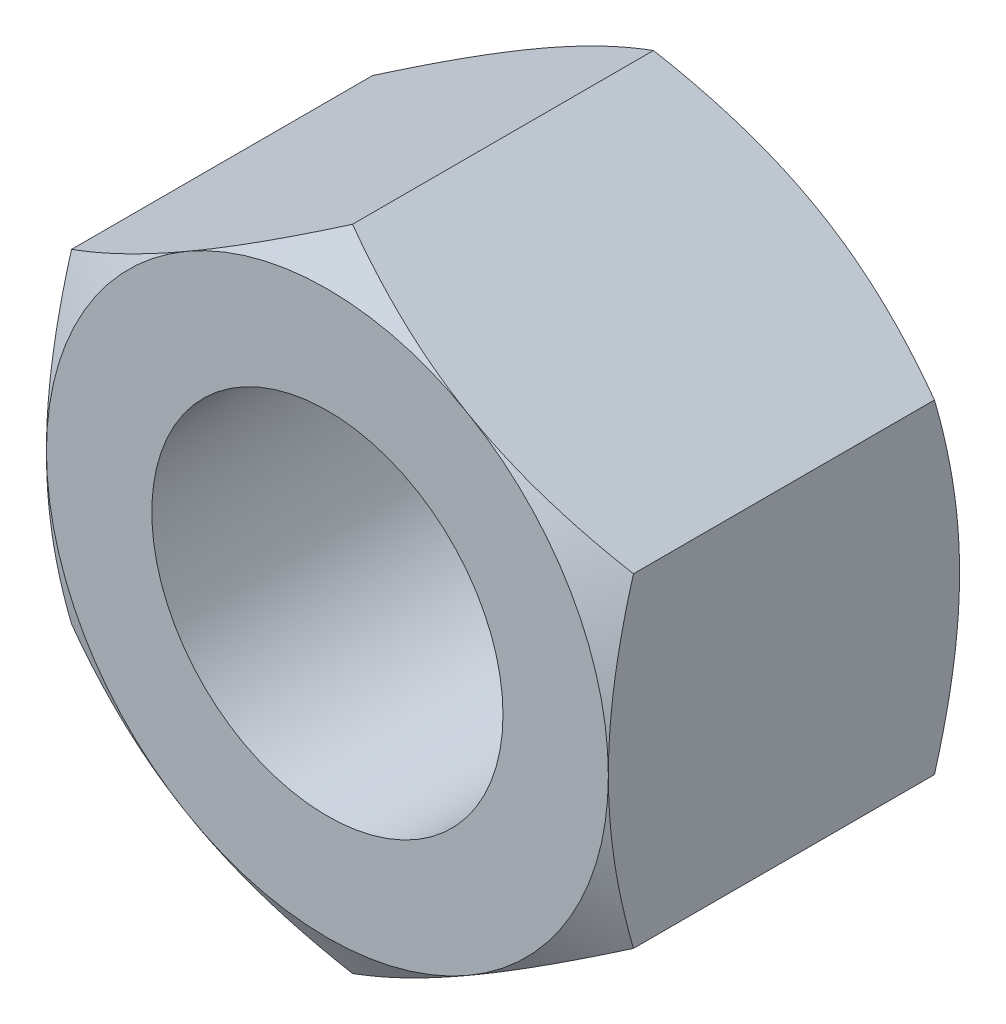
ISO-10303-21;
HEADER;
FILE_DESCRIPTION(('STEP AP214'),'2;1');
FILE_NAME('part.step','',(''),(''),'','','');
FILE_SCHEMA(('AUTOMOTIVE_DESIGN { 1 0 10303 214 1 1 1 1 }'));
ENDSEC;
DATA;
#1=APPLICATION_CONTEXT('core data for automotive mechanical design processes');
#2=APPLICATION_PROTOCOL_DEFINITION('international standard','automotive_design',2000,#1);
#3=PRODUCT_CONTEXT('',#1,'mechanical');
#4=PRODUCT('Part','Part','',(#3));
#5=PRODUCT_RELATED_PRODUCT_CATEGORY('part','',(#4));
#6=PRODUCT_DEFINITION_FORMATION('','',#4);
#7=PRODUCT_DEFINITION_CONTEXT('part definition',#1,'design');
#8=PRODUCT_DEFINITION('design','',#6,#7);
#9=PRODUCT_DEFINITION_SHAPE('','',#8);
#10=(LENGTH_UNIT() NAMED_UNIT(*) SI_UNIT(.MILLI.,.METRE.));
#11=(NAMED_UNIT(*) PLANE_ANGLE_UNIT() SI_UNIT($,.RADIAN.));
#12=(NAMED_UNIT(*) SI_UNIT($,.STERADIAN.) SOLID_ANGLE_UNIT());
#13=UNCERTAINTY_MEASURE_WITH_UNIT(LENGTH_MEASURE(1.E-05),#10,'distance_accuracy_value','');
#14=(GEOMETRIC_REPRESENTATION_CONTEXT(3) GLOBAL_UNCERTAINTY_ASSIGNED_CONTEXT((#13)) GLOBAL_UNIT_ASSIGNED_CONTEXT((#10,
#11,#12)) REPRESENTATION_CONTEXT('',''));
#15=CARTESIAN_POINT('',(0.,0.,0.));
#16=DIRECTION('',(0.,0.,1.));
#17=DIRECTION('',(1.,0.,0.));
#18=AXIS2_PLACEMENT_3D('',#15,#16,#17);
#19=CARTESIAN_POINT('',(0.,0.,5.));
#20=DIRECTION('',(0.,0.,1.));
#21=DIRECTION('',(1.,0.,0.));
#22=AXIS2_PLACEMENT_3D('',#19,#20,#21);
#23=PLANE('',#22);
#24=CARTESIAN_POINT('',(0.,0.,5.));
#25=DIRECTION('',(0.,0.,1.));
#26=DIRECTION('',(1.,0.,0.));
#27=AXIS2_PLACEMENT_3D('',#24,#25,#26);
#28=CIRCLE('',#27,3.99999999999999);
#29=CARTESIAN_POINT('',(4.,0.,5.));
#30=VERTEX_POINT('',#29);
#31=CARTESIAN_POINT('',(2.00000000000001,-3.46410161513775,5.));
#32=VERTEX_POINT('',#31);
#33=EDGE_CURVE('E11',#30,#32,#28,.F.);
#34=ORIENTED_EDGE('',*,*,#33,.F.);
#35=CARTESIAN_POINT('',(2.00000000000001,3.46410161513775,5.));
#36=VERTEX_POINT('',#35);
#37=EDGE_CURVE('E38',#36,#30,#28,.F.);
#38=ORIENTED_EDGE('',*,*,#37,.F.);
#39=CARTESIAN_POINT('',(-1.99999999999999,3.46410161513776,5.));
#40=VERTEX_POINT('',#39);
#41=EDGE_CURVE('E277',#40,#36,#28,.F.);
#42=ORIENTED_EDGE('',*,*,#41,.F.);
#43=CARTESIAN_POINT('',(-4.,0.,5.));
#44=VERTEX_POINT('',#43);
#45=EDGE_CURVE('E281',#44,#40,#28,.F.);
#46=ORIENTED_EDGE('',*,*,#45,.F.);
#47=CARTESIAN_POINT('',(-1.99999999999999,-3.46410161513776,5.));
#48=VERTEX_POINT('',#47);
#49=EDGE_CURVE('E305',#48,#44,#28,.F.);
#50=ORIENTED_EDGE('',*,*,#49,.F.);
#51=EDGE_CURVE('E43',#32,#48,#28,.F.);
#52=ORIENTED_EDGE('',*,*,#51,.F.);
#53=EDGE_LOOP('',(#34,#38,#42,#46,#50,#52));
#54=FACE_BOUND('',#53,.T.);
#55=CARTESIAN_POINT('',(0.,0.,5.));
#56=DIRECTION('',(0.,0.,1.));
#57=DIRECTION('',(1.,0.,0.));
#58=AXIS2_PLACEMENT_3D('',#55,#56,#57);
#59=CIRCLE('',#58,2.5);
#60=CARTESIAN_POINT('',(2.5,0.,5.));
#61=VERTEX_POINT('',#60);
#62=EDGE_CURVE('E248',#61,#61,#59,.T.);
#63=ORIENTED_EDGE('',*,*,#62,.F.);
#64=EDGE_LOOP('',(#63));
#65=FACE_BOUND('',#64,.T.);
#66=ADVANCED_FACE('F33',(#54,#65),#23,.T.);
#67=CARTESIAN_POINT('',(0.,0.,0.));
#68=DIRECTION('',(0.,0.,1.));
#69=DIRECTION('',(1.,0.,0.));
#70=AXIS2_PLACEMENT_3D('',#67,#68,#69);
#71=PLANE('',#70);
#72=CARTESIAN_POINT('',(0.,0.,0.));
#73=DIRECTION('',(0.,0.,1.));
#74=DIRECTION('',(1.,0.,0.));
#75=AXIS2_PLACEMENT_3D('',#72,#73,#74);
#76=CIRCLE('',#75,2.5);
#77=CARTESIAN_POINT('',(2.5,0.,0.));
#78=VERTEX_POINT('',#77);
#79=EDGE_CURVE('E251',#78,#78,#76,.F.);
#80=ORIENTED_EDGE('',*,*,#79,.F.);
#81=EDGE_LOOP('',(#80));
#82=FACE_BOUND('',#81,.T.);
#83=CARTESIAN_POINT('',(0.,0.,0.));
#84=DIRECTION('',(0.,0.,1.));
#85=DIRECTION('',(1.,0.,0.));
#86=AXIS2_PLACEMENT_3D('',#83,#84,#85);
#87=CIRCLE('',#86,3.99999999999999);
#88=CARTESIAN_POINT('',(2.,3.46410161513775,0.));
#89=VERTEX_POINT('',#88);
#90=CARTESIAN_POINT('',(4.,0.,0.));
#91=VERTEX_POINT('',#90);
#92=EDGE_CURVE('E142',#89,#91,#87,.F.);
#93=ORIENTED_EDGE('',*,*,#92,.T.);
#94=CARTESIAN_POINT('',(2.,-3.46410161513776,0.));
#95=VERTEX_POINT('',#94);
#96=EDGE_CURVE('E150',#91,#95,#87,.F.);
#97=ORIENTED_EDGE('',*,*,#96,.T.);
#98=CARTESIAN_POINT('',(-2.,-3.46410161513776,0.));
#99=VERTEX_POINT('',#98);
#100=EDGE_CURVE('E288',#95,#99,#87,.F.);
#101=ORIENTED_EDGE('',*,*,#100,.T.);
#102=CARTESIAN_POINT('',(-4.,0.,0.));
#103=VERTEX_POINT('',#102);
#104=EDGE_CURVE('E291',#99,#103,#87,.F.);
#105=ORIENTED_EDGE('',*,*,#104,.T.);
#106=CARTESIAN_POINT('',(-2.,3.46410161513776,0.));
#107=VERTEX_POINT('',#106);
#108=EDGE_CURVE('E154',#103,#107,#87,.F.);
#109=ORIENTED_EDGE('',*,*,#108,.T.);
#110=EDGE_CURVE('E128',#107,#89,#87,.F.);
#111=ORIENTED_EDGE('',*,*,#110,.T.);
#112=EDGE_LOOP('',(#93,#97,#101,#105,#109,#111));
#113=FACE_BOUND('',#112,.T.);
#114=ADVANCED_FACE('F151',(#82,#113),#71,.F.);
#115=CARTESIAN_POINT('',(0.,0.,-0.00100000000000013));
#116=DIRECTION('',(0.,0.,1.));
#117=DIRECTION('',(1.,0.,0.));
#118=AXIS2_PLACEMENT_3D('',#115,#116,#117);
#119=CYLINDRICAL_SURFACE('',#118,2.5);
#120=ORIENTED_EDGE('',*,*,#62,.T.);
#121=EDGE_LOOP('',(#120));
#122=FACE_BOUND('',#121,.T.);
#123=ORIENTED_EDGE('',*,*,#79,.T.);
#124=EDGE_LOOP('',(#123));
#125=FACE_BOUND('',#124,.T.);
#126=ADVANCED_FACE('F333',(#122,#125),#119,.F.);
#127=CARTESIAN_POINT('',(0.,0.,2.49999999999999));
#128=DIRECTION('',(0.,0.,1.));
#129=DIRECTION('',(1.,0.,0.));
#130=AXIS2_PLACEMENT_3D('',#127,#128,#129);
#131=CONICAL_SURFACE('',#130,8.33012701892224,1.0471975511966);
#132=CARTESIAN_POINT('',(4.,-6.24956479429045,1.97456360244672));
#133=CARTESIAN_POINT('',(4.,-6.07444156413654,1.88942827325907));
#134=CARTESIAN_POINT('',(4.,-5.89892120925633,1.80509607824784));
#135=CARTESIAN_POINT('',(4.,-5.54687519091733,1.63848882539641));
#136=CARTESIAN_POINT('',(4.,-5.37034937829518,1.55621408309027));
#137=CARTESIAN_POINT('',(4.,-5.01519415342951,1.39376866021859));
#138=CARTESIAN_POINT('',(4.,-4.83655854832306,1.31361147319812));
#139=CARTESIAN_POINT('',(4.,-4.47788234370767,1.15651692570027));
#140=CARTESIAN_POINT('',(4.,-4.29784180976291,1.07957941602297));
#141=CARTESIAN_POINT('',(4.,-3.93013224001484,0.927314347669686));
#142=CARTESIAN_POINT('',(4.,-3.74240672926811,0.852122439616751));
#143=CARTESIAN_POINT('',(4.,-3.36477669699491,0.707318313824162));
#144=CARTESIAN_POINT('',(4.,-3.17487193622275,0.637706715540834));
#145=CARTESIAN_POINT('',(4.,-2.79292180874069,0.505856446606606));
#146=CARTESIAN_POINT('',(4.,-2.60088150479679,0.443603254920114));
#147=CARTESIAN_POINT('',(4.,-2.21404661724717,0.328436603960456));
#148=CARTESIAN_POINT('',(4.,-2.01925290675912,0.275520252647028));
#149=CARTESIAN_POINT('',(4.,-1.62786565756198,0.181813669941697));
#150=CARTESIAN_POINT('',(4.,-1.43128819547987,0.140957514167184));
#151=CARTESIAN_POINT('',(4.,-1.03564122557711,0.0736566788754475));
#152=CARTESIAN_POINT('',(4.,-0.836571977728894,0.0472105085497938));
#153=CARTESIAN_POINT('',(4.,-0.43955577127103,0.0111835710773818));
#154=CARTESIAN_POINT('',(4.,-0.241629330228168,0.00138228122554302));
#155=CARTESIAN_POINT('',(4.,0.15435054835947,-0.00110741340924523));
#156=CARTESIAN_POINT('',(4.,0.352403988458628,0.00620453754175364));
#157=CARTESIAN_POINT('',(4.,0.687236250688567,0.032510892652731));
#158=CARTESIAN_POINT('',(4.,0.824367793925697,0.0472858846929974));
#159=CARTESIAN_POINT('',(4.,1.09765152952022,0.0841455799911596));
#160=CARTESIAN_POINT('',(4.,1.23380359194277,0.106231235433355));
#161=CARTESIAN_POINT('',(4.,1.6405917983731,0.18229587673389));
#162=CARTESIAN_POINT('',(4.,1.90941813145405,0.246069891819845));
#163=CARTESIAN_POINT('',(4.,2.31153879676533,0.356988486413043));
#164=CARTESIAN_POINT('',(4.,2.44690727933547,0.397044262071004));
#165=CARTESIAN_POINT('',(4.,2.71632951260011,0.481395746605353));
#166=CARTESIAN_POINT('',(4.,2.85038325360041,0.525691486719118));
#167=CARTESIAN_POINT('',(4.,3.11721830577763,0.617805331265835));
#168=CARTESIAN_POINT('',(4.,3.24999999051481,0.665622363398113));
#169=CARTESIAN_POINT('',(4.,3.51445652868967,0.764208166002603));
#170=CARTESIAN_POINT('',(4.,3.64613140388332,0.814976878299175));
#171=CARTESIAN_POINT('',(4.,3.98960714481433,0.951124538665885));
#172=CARTESIAN_POINT('',(4.,4.20061716756433,1.03849638210907));
#173=CARTESIAN_POINT('',(4.,4.62056636292152,1.21809912278108));
#174=CARTESIAN_POINT('',(4.,4.82950533512367,1.31033048489121));
#175=CARTESIAN_POINT('',(4.,5.24576018930462,1.49854028991968));
#176=CARTESIAN_POINT('',(4.,5.45307555654103,1.59451986767299));
#177=CARTESIAN_POINT('',(4.,5.86634547345445,1.7893711183019));
#178=CARTESIAN_POINT('',(4.,6.07229998492681,1.88824287195307));
#179=CARTESIAN_POINT('',(4.,6.48339063309609,2.08840661813017));
#180=CARTESIAN_POINT('',(4.,6.68852518457306,2.18970185997189));
#181=CARTESIAN_POINT('',(4.,7.09788129540636,2.39412248897985));
#182=CARTESIAN_POINT('',(4.,7.302102845505,2.49724789465118));
#183=CARTESIAN_POINT('',(4.,7.91356393553836,2.80878595966479));
#184=CARTESIAN_POINT('',(4.,8.3196812269123,3.01940043013483));
#185=CARTESIAN_POINT('',(4.,9.08923369645318,3.42329199215687));
#186=CARTESIAN_POINT('',(4.,9.45286795571535,3.61619156178197));
#187=CARTESIAN_POINT('',(4.,10.1788898998377,4.00436787612635));
#188=CARTESIAN_POINT('',(4.,10.5412775165095,4.19964474830796));
#189=CARTESIAN_POINT('',(4.,11.2639691493924,4.59136023392863));
#190=CARTESIAN_POINT('',(4.,11.6242761419106,4.78779336487934));
#191=CARTESIAN_POINT('',(4.,12.344109455928,5.1820245684433));
#192=CARTESIAN_POINT('',(4.,12.7036358313906,5.37982254248305));
#193=CARTESIAN_POINT('',(4.,13.0628848233634,5.57811986686827));
#194=B_SPLINE_CURVE_WITH_KNOTS('',3,(#132,#133,#134,#135,#136,#137,#138,#139,#140,#141,#142,
#143,#144,#145,#146,#147,#148,#149,#150,#151,#152,#153,#154,#155,#156,#157,#158,#159,#160,#161,
#162,#163,#164,#165,#166,#167,#168,#169,#170,#171,#172,#173,#174,#175,#176,#177,#178,#179,#180,
#181,#182,#183,#184,#185,#186,#187,#188,#189,#190,#191,#192,#193),.UNSPECIFIED.,.F.,.F.,(4,2,2,
2,2,2,2,2,2,2,2,2,2,2,2,2,2,2,2,2,2,2,2,2,2,2,2,2,2,2,4),(0.,0.584169167729591,1.16842738181916,
1.75578823273105,2.3431218351209,2.94972631181604,3.55639803318819,4.16185182498552,
4.76711774997747,5.36901110458358,5.97084217750695,6.56463571900412,7.15844160383236,
7.57201755614221,7.98564739625398,8.81333230952328,9.23680647972617,9.66028377005908,
10.0836326325238,10.5069731538927,11.1920349716865,11.8771624446906,12.5624989846245,
13.2478546836303,13.9341874141275,14.6205270882075,15.9929346612935,17.2278187412332,
18.4627693253535,19.6938892311648,20.9249211331408),.UNSPECIFIED.);
#195=CARTESIAN_POINT('',(4.,2.3094010767585,0.35726558990816));
#196=VERTEX_POINT('',#195);
#197=EDGE_CURVE('E145',#91,#196,#194,.T.);
#198=ORIENTED_EDGE('',*,*,#197,.F.);
#199=ORIENTED_EDGE('',*,*,#92,.F.);
#200=CARTESIAN_POINT('',(4.0002,2.30928560670467,0.357332259074763));
#201=CARTESIAN_POINT('',(3.82442084967677,2.4107717464617,0.29871787364828));
#202=CARTESIAN_POINT('',(3.64712438367362,2.51313390883499,0.245410321462261));
#203=CARTESIAN_POINT('',(3.28946140682429,2.71963072479812,0.152361670746403));
#204=CARTESIAN_POINT('',(3.10908854102985,2.82376904741904,0.112653489029704));
#205=CARTESIAN_POINT('',(2.75057818129721,3.03075510011795,0.0508422152802797));
#206=CARTESIAN_POINT('',(2.57249584706486,3.13357098372492,0.0283277315228901));
#207=CARTESIAN_POINT('',(2.21549328283349,3.33968651028528,0.00145062314658378));
#208=CARTESIAN_POINT('',(2.0365743503559,3.44298540411434,-0.00293425857305483));
#209=CARTESIAN_POINT('',(1.70225715780327,3.63600352522932,0.00619007293997213));
#210=CARTESIAN_POINT('',(1.54680884001293,3.72575165335065,0.017458953987996));
#211=CARTESIAN_POINT('',(1.23692494436494,3.90466320392054,0.0531739907981946));
#212=CARTESIAN_POINT('',(1.08249043825587,3.99382600759478,0.0776323457115342));
#213=CARTESIAN_POINT('',(0.771967672225422,4.17310641015197,0.13877606491929));
#214=CARTESIAN_POINT('',(0.615918711936898,4.26320131938131,0.175720603654864));
#215=CARTESIAN_POINT('',(0.306148164596161,4.4420474282755,0.259570072548027));
#216=CARTESIAN_POINT('',(0.152422609226221,4.53080091904966,0.30645530221274));
#217=CARTESIAN_POINT('',(-0.00019999999999995,4.61891762357084,0.357332259074765));
#218=B_SPLINE_CURVE_WITH_KNOTS('',3,(#200,#201,#202,#203,#204,#205,#206,#207,#208,#209,#210,
#211,#212,#213,#214,#215,#216,#217),.UNSPECIFIED.,.F.,.F.,(4,2,2,2,2,2,2,2,4),(0.,
0.634047835695966,1.26961969224543,1.88946157213122,2.50854226669297,3.04757825393386,
3.58711366126903,4.13861653143764,4.68903648037743),.UNSPECIFIED.);
#219=EDGE_CURVE('E138',#196,#89,#218,.T.);
#220=ORIENTED_EDGE('',*,*,#219,.F.);
#221=EDGE_LOOP('',(#198,#199,#220));
#222=FACE_BOUND('',#221,.T.);
#223=ADVANCED_FACE('F143',(#222),#131,.T.);
#224=CARTESIAN_POINT('',(0.,4.61880215351701,0.357265589908162));
#225=VERTEX_POINT('',#224);
#226=EDGE_CURVE('E124',#89,#225,#218,.T.);
#227=ORIENTED_EDGE('',*,*,#226,.F.);
#228=ORIENTED_EDGE('',*,*,#110,.F.);
#229=CARTESIAN_POINT('',(0.000199999999999757,4.61891762357084,0.357332259074766));
#230=CARTESIAN_POINT('',(-0.175579150323229,4.5174314838138,0.298717873648282));
#231=CARTESIAN_POINT('',(-0.352875616326381,4.41506932144052,0.245410321462263));
#232=CARTESIAN_POINT('',(-0.710538593175706,4.2085725054774,0.152361670746405));
#233=CARTESIAN_POINT('',(-0.89091145897015,4.10443418285647,0.112653489029706));
#234=CARTESIAN_POINT('',(-1.24942181870279,3.89744813015756,0.0508422152802819));
#235=CARTESIAN_POINT('',(-1.42750415293514,3.79463224655059,0.028327731522892));
#236=CARTESIAN_POINT('',(-1.78450671716651,3.58851671999023,0.00145062314658541));
#237=CARTESIAN_POINT('',(-1.9634256496441,3.48521782616117,-0.00293425857305299));
#238=CARTESIAN_POINT('',(-2.29774284219673,3.29219970504619,0.00619007293997381));
#239=CARTESIAN_POINT('',(-2.45319115998707,3.20245157692486,0.0174589539879975));
#240=CARTESIAN_POINT('',(-2.76307505563505,3.02354002635497,0.053173990798196));
#241=CARTESIAN_POINT('',(-2.91750956174413,2.93437722268073,0.0776323457115359));
#242=CARTESIAN_POINT('',(-3.22803232777458,2.75509682012354,0.138776064919292));
#243=CARTESIAN_POINT('',(-3.3840812880631,2.6650019108942,0.175720603654865));
#244=CARTESIAN_POINT('',(-3.69385183540384,2.48615580200001,0.259570072548028));
#245=CARTESIAN_POINT('',(-3.84757739077378,2.39740231122585,0.306455302212741));
#246=CARTESIAN_POINT('',(-4.0002,2.30928560670467,0.357332259074768));
#247=B_SPLINE_CURVE_WITH_KNOTS('',3,(#229,#230,#231,#232,#233,#234,#235,#236,#237,#238,#239,
#240,#241,#242,#243,#244,#245,#246),.UNSPECIFIED.,.F.,.F.,(4,2,2,2,2,2,2,2,4),(0.,
0.634047835695965,1.26961969224543,1.88946157213122,2.50854226669297,3.04757825393385,
3.58711366126903,4.13861653143764,4.68903648037743),.UNSPECIFIED.);
#248=EDGE_CURVE('E131',#225,#107,#247,.T.);
#249=ORIENTED_EDGE('',*,*,#248,.F.);
#250=EDGE_LOOP('',(#227,#228,#249));
#251=FACE_BOUND('',#250,.T.);
#252=ADVANCED_FACE('F126',(#251),#131,.T.);
#253=CARTESIAN_POINT('',(-4.,2.3094010767585,0.357265589908164));
#254=VERTEX_POINT('',#253);
#255=EDGE_CURVE('E204',#107,#254,#247,.T.);
#256=ORIENTED_EDGE('',*,*,#255,.F.);
#257=ORIENTED_EDGE('',*,*,#108,.F.);
#258=CARTESIAN_POINT('',(-4.,-6.24956479429043,1.97456360244672));
#259=CARTESIAN_POINT('',(-4.,-6.07444156413653,1.88942827325907));
#260=CARTESIAN_POINT('',(-4.,-5.89892120925632,1.80509607824784));
#261=CARTESIAN_POINT('',(-4.,-5.54687519091731,1.63848882539642));
#262=CARTESIAN_POINT('',(-4.,-5.37034937829516,1.55621408309027));
#263=CARTESIAN_POINT('',(-4.,-5.01519415342949,1.39376866021859));
#264=CARTESIAN_POINT('',(-4.,-4.83655854832305,1.31361147319813));
#265=CARTESIAN_POINT('',(-4.,-4.47788234370766,1.15651692570027));
#266=CARTESIAN_POINT('',(-4.,-4.29784180976289,1.07957941602297));
#267=CARTESIAN_POINT('',(-4.,-3.93013224001483,0.927314347669689));
#268=CARTESIAN_POINT('',(-4.,-3.7424067292681,0.852122439616753));
#269=CARTESIAN_POINT('',(-4.,-3.36477669699491,0.707318313824164));
#270=CARTESIAN_POINT('',(-4.,-3.17487193622275,0.637706715540837));
#271=CARTESIAN_POINT('',(-4.,-2.79292180874068,0.505856446606609));
#272=CARTESIAN_POINT('',(-4.,-2.60088150479678,0.443603254920117));
#273=CARTESIAN_POINT('',(-4.,-2.21404661724717,0.32843660396046));
#274=CARTESIAN_POINT('',(-4.,-2.01925290675911,0.275520252647032));
#275=CARTESIAN_POINT('',(-4.,-1.62786565756197,0.181813669941701));
#276=CARTESIAN_POINT('',(-4.,-1.43128819547986,0.140957514167188));
#277=CARTESIAN_POINT('',(-4.,-1.03564122557711,0.0736566788754504));
#278=CARTESIAN_POINT('',(-4.,-0.836571977728894,0.0472105085497965));
#279=CARTESIAN_POINT('',(-4.,-0.439555771271032,0.0111835710773843));
#280=CARTESIAN_POINT('',(-4.,-0.24162933022817,0.0013822812255456));
#281=CARTESIAN_POINT('',(-4.,0.154350548359467,-0.00110741340924309));
#282=CARTESIAN_POINT('',(-4.,0.352403988458625,0.0062045375417553));
#283=CARTESIAN_POINT('',(-4.,0.687236250688563,0.0325108926527331));
#284=CARTESIAN_POINT('',(-4.,0.824367793925693,0.047285884693));
#285=CARTESIAN_POINT('',(-4.,1.09765152952022,0.0841455799911624));
#286=CARTESIAN_POINT('',(-4.,1.23380359194277,0.106231235433357));
#287=CARTESIAN_POINT('',(-4.,1.64059179837309,0.182295876733892));
#288=CARTESIAN_POINT('',(-4.,1.90941813145404,0.246069891819847));
#289=CARTESIAN_POINT('',(-4.,2.31153879676532,0.356988486413044));
#290=CARTESIAN_POINT('',(-4.,2.44690727933546,0.397044262071004));
#291=CARTESIAN_POINT('',(-4.,2.7163295126001,0.481395746605353));
#292=CARTESIAN_POINT('',(-4.,2.85038325360039,0.525691486719117));
#293=CARTESIAN_POINT('',(-4.,3.11721830577761,0.617805331265834));
#294=CARTESIAN_POINT('',(-4.,3.24999999051479,0.665622363398111));
#295=CARTESIAN_POINT('',(-4.,3.51445652868965,0.764208166002601));
#296=CARTESIAN_POINT('',(-4.,3.6461314038833,0.814976878299173));
#297=CARTESIAN_POINT('',(-4.,3.98960714481431,0.951124538665883));
#298=CARTESIAN_POINT('',(-4.,4.20061716756431,1.03849638210907));
#299=CARTESIAN_POINT('',(-4.,4.6205663629215,1.21809912278108));
#300=CARTESIAN_POINT('',(-4.,4.82950533512366,1.3103304848912));
#301=CARTESIAN_POINT('',(-4.,5.2457601893046,1.49854028991968));
#302=CARTESIAN_POINT('',(-4.,5.45307555654102,1.59451986767299));
#303=CARTESIAN_POINT('',(-4.,5.86634547345444,1.7893711183019));
#304=CARTESIAN_POINT('',(-4.,6.07229998492679,1.88824287195307));
#305=CARTESIAN_POINT('',(-4.,6.48339063309607,2.08840661813016));
#306=CARTESIAN_POINT('',(-4.,6.68852518457305,2.18970185997189));
#307=CARTESIAN_POINT('',(-4.,7.09788129540634,2.39412248897985));
#308=CARTESIAN_POINT('',(-4.,7.30210284550498,2.49724789465118));
#309=CARTESIAN_POINT('',(-4.,7.91356393553835,2.80878595966479));
#310=CARTESIAN_POINT('',(-4.,8.31968122691228,3.01940043013483));
#311=CARTESIAN_POINT('',(-4.,9.08923369645316,3.42329199215687));
#312=CARTESIAN_POINT('',(-4.,9.45286795571533,3.61619156178197));
#313=CARTESIAN_POINT('',(-4.,10.1788898998377,4.00436787612635));
#314=CARTESIAN_POINT('',(-4.,10.5412775165095,4.19964474830796));
#315=CARTESIAN_POINT('',(-4.,11.2639691493924,4.59136023392863));
#316=CARTESIAN_POINT('',(-4.,11.6242761419106,4.78779336487933));
#317=CARTESIAN_POINT('',(-4.,12.344109455928,5.1820245684433));
#318=CARTESIAN_POINT('',(-4.,12.7036358313906,5.37982254248305));
#319=CARTESIAN_POINT('',(-4.,13.0628848233633,5.57811986686827));
#320=B_SPLINE_CURVE_WITH_KNOTS('',3,(#258,#259,#260,#261,#262,#263,#264,#265,#266,#267,#268,
#269,#270,#271,#272,#273,#274,#275,#276,#277,#278,#279,#280,#281,#282,#283,#284,#285,#286,#287,
#288,#289,#290,#291,#292,#293,#294,#295,#296,#297,#298,#299,#300,#301,#302,#303,#304,#305,#306,
#307,#308,#309,#310,#311,#312,#313,#314,#315,#316,#317,#318,#319),.UNSPECIFIED.,.F.,.F.,(4,2,2,
2,2,2,2,2,2,2,2,2,2,2,2,2,2,2,2,2,2,2,2,2,2,2,2,2,2,2,4),(0.,0.584169167729592,1.16842738181916,
1.75578823273105,2.3431218351209,2.94972631181603,3.55639803318818,4.16185182498551,
4.76711774997746,5.36901110458357,5.97084217750694,6.5646357190041,7.15844160383234,
7.5720175561422,7.98564739625396,8.81333230952326,9.23680647972614,9.66028377005906,
10.0836326325238,10.5069731538926,11.1920349716865,11.8771624446906,12.5624989846245,
13.2478546836303,13.9341874141274,14.6205270882074,15.9929346612935,17.2278187412331,
18.4627693253534,19.6938892311648,20.9249211331408),.UNSPECIFIED.);
#321=EDGE_CURVE('E197',#254,#103,#320,.F.);
#322=ORIENTED_EDGE('',*,*,#321,.F.);
#323=EDGE_LOOP('',(#256,#257,#322));
#324=FACE_BOUND('',#323,.T.);
#325=ADVANCED_FACE('F300',(#324),#131,.T.);
#326=CARTESIAN_POINT('',(-4.,-2.30940107675886,0.357265589907926));
#327=VERTEX_POINT('',#326);
#328=EDGE_CURVE('E203',#103,#327,#320,.F.);
#329=ORIENTED_EDGE('',*,*,#328,.F.);
#330=ORIENTED_EDGE('',*,*,#104,.F.);
#331=CARTESIAN_POINT('',(-4.0002,-2.30928560670467,0.357332259074767));
#332=CARTESIAN_POINT('',(-3.82442084967677,-2.4107717464617,0.298717873648283));
#333=CARTESIAN_POINT('',(-3.64712438367362,-2.51313390883499,0.245410321462264));
#334=CARTESIAN_POINT('',(-3.28946140682429,-2.71963072479811,0.152361670746406));
#335=CARTESIAN_POINT('',(-3.10908854102985,-2.82376904741904,0.112653489029707));
#336=CARTESIAN_POINT('',(-2.75057818129721,-3.03075510011795,0.0508422152802823));
#337=CARTESIAN_POINT('',(-2.57249584706486,-3.13357098372491,0.0283277315228921));
#338=CARTESIAN_POINT('',(-2.2154932828335,-3.33968651028528,0.00145062314658501));
#339=CARTESIAN_POINT('',(-2.0365743503559,-3.44298540411434,-0.00293425857305367));
#340=CARTESIAN_POINT('',(-1.70225715780327,-3.63600352522932,0.0061900729399727));
#341=CARTESIAN_POINT('',(-1.54680884001294,-3.72575165335064,0.0174589539879962));
#342=CARTESIAN_POINT('',(-1.23692494436495,-3.90466320392054,0.0531739907981946));
#343=CARTESIAN_POINT('',(-1.08249043825587,-3.99382600759478,0.0776323457115344));
#344=CARTESIAN_POINT('',(-0.771967672225424,-4.17310641015197,0.13877606491929));
#345=CARTESIAN_POINT('',(-0.6159187119369,-4.26320131938131,0.175720603654864));
#346=CARTESIAN_POINT('',(-0.306148164596162,-4.4420474282755,0.259570072548026));
#347=CARTESIAN_POINT('',(-0.152422609226222,-4.53080091904966,0.306455302212739));
#348=CARTESIAN_POINT('',(0.000199999999999847,-4.61891762357084,0.357332259074766));
#349=B_SPLINE_CURVE_WITH_KNOTS('',3,(#331,#332,#333,#334,#335,#336,#337,#338,#339,#340,#341,
#342,#343,#344,#345,#346,#347,#348),.UNSPECIFIED.,.F.,.F.,(4,2,2,2,2,2,2,2,4),(0.,
0.634047835695965,1.26961969224543,1.88946157213122,2.50854226669296,3.04757825393385,
3.58711366126903,4.13861653143763,4.68903648037743),.UNSPECIFIED.);
#350=EDGE_CURVE('E205',#327,#99,#349,.T.);
#351=ORIENTED_EDGE('',*,*,#350,.F.);
#352=EDGE_LOOP('',(#329,#330,#351));
#353=FACE_BOUND('',#352,.T.);
#354=ADVANCED_FACE('F182',(#353),#131,.T.);
#355=CARTESIAN_POINT('',(0.,-4.61880215351701,0.357265589908162));
#356=VERTEX_POINT('',#355);
#357=EDGE_CURVE('E353',#99,#356,#349,.T.);
#358=ORIENTED_EDGE('',*,*,#357,.F.);
#359=ORIENTED_EDGE('',*,*,#100,.F.);
#360=CARTESIAN_POINT('',(-0.000200000000000415,-4.61891762357084,0.357332259074766));
#361=CARTESIAN_POINT('',(0.175579150323227,-4.51743148381381,0.298717873648281));
#362=CARTESIAN_POINT('',(0.35287561632638,-4.41506932144052,0.245410321462262));
#363=CARTESIAN_POINT('',(0.710538593175705,-4.20857250547739,0.152361670746404));
#364=CARTESIAN_POINT('',(0.89091145897015,-4.10443418285647,0.112653489029706));
#365=CARTESIAN_POINT('',(1.24942181870279,-3.89744813015756,0.0508422152802811));
#366=CARTESIAN_POINT('',(1.42750415293514,-3.79463224655059,0.0283277315228905));
#367=CARTESIAN_POINT('',(1.78450671716651,-3.58851671999023,0.00145062314658373));
#368=CARTESIAN_POINT('',(1.9634256496441,-3.48521782616117,-0.00293425857305431));
#369=CARTESIAN_POINT('',(2.29774284219673,-3.29219970504619,0.0061900729399725));
#370=CARTESIAN_POINT('',(2.45319115998706,-3.20245157692487,0.0174589539879959));
#371=CARTESIAN_POINT('',(2.76307505563505,-3.02354002635497,0.0531739907981937));
#372=CARTESIAN_POINT('',(2.91750956174413,-2.93437722268073,0.0776323457115332));
#373=CARTESIAN_POINT('',(3.22803232777458,-2.75509682012354,0.138776064919289));
#374=CARTESIAN_POINT('',(3.3840812880631,-2.6650019108942,0.175720603654863));
#375=CARTESIAN_POINT('',(3.69385183540384,-2.48615580200001,0.259570072548025));
#376=CARTESIAN_POINT('',(3.84757739077378,-2.39740231122585,0.306455302212738));
#377=CARTESIAN_POINT('',(4.0002,-2.30928560670467,0.357332259074764));
#378=B_SPLINE_CURVE_WITH_KNOTS('',3,(#360,#361,#362,#363,#364,#365,#366,#367,#368,#369,#370,
#371,#372,#373,#374,#375,#376,#377),.UNSPECIFIED.,.F.,.F.,(4,2,2,2,2,2,2,2,4),(0.,
0.634047835695965,1.26961969224543,1.88946157213122,2.50854226669297,3.04757825393385,
3.58711366126903,4.13861653143763,4.68903648037743),.UNSPECIFIED.);
#379=EDGE_CURVE('E163',#356,#95,#378,.T.);
#380=ORIENTED_EDGE('',*,*,#379,.F.);
#381=EDGE_LOOP('',(#358,#359,#380));
#382=FACE_BOUND('',#381,.T.);
#383=ADVANCED_FACE('F177',(#382),#131,.T.);
#384=CARTESIAN_POINT('',(4.,-2.3094010767585,0.35726558990816));
#385=VERTEX_POINT('',#384);
#386=EDGE_CURVE('E159',#95,#385,#378,.T.);
#387=ORIENTED_EDGE('',*,*,#386,.F.);
#388=ORIENTED_EDGE('',*,*,#96,.F.);
#389=EDGE_CURVE('E136',#385,#91,#194,.T.);
#390=ORIENTED_EDGE('',*,*,#389,.F.);
#391=EDGE_LOOP('',(#387,#388,#390));
#392=FACE_BOUND('',#391,.T.);
#393=ADVANCED_FACE('F181',(#392),#131,.T.);
#394=CARTESIAN_POINT('',(0.,0.,6.));
#395=DIRECTION('',(0.,0.,-1.));
#396=DIRECTION('',(-1.,0.,0.));
#397=AXIS2_PLACEMENT_3D('',#394,#395,#396);
#398=CONICAL_SURFACE('',#397,2.2679491924311,1.0471975511966);
#399=CARTESIAN_POINT('',(-0.000200000000000369,4.61891762357084,4.64266774092523));
#400=CARTESIAN_POINT('',(0.175579150323228,4.5174314838138,4.70128212635171));
#401=CARTESIAN_POINT('',(0.352875616326381,4.41506932144052,4.75458967853773));
#402=CARTESIAN_POINT('',(0.710538593175706,4.2085725054774,4.84763832925359));
#403=CARTESIAN_POINT('',(0.89091145897015,4.10443418285647,4.88734651097029));
#404=CARTESIAN_POINT('',(1.24942181870279,3.89744813015756,4.94915778471971));
#405=CARTESIAN_POINT('',(1.42750415293514,3.79463224655059,4.9716722684771));
#406=CARTESIAN_POINT('',(1.78450671716651,3.58851671999023,4.99854937685341));
#407=CARTESIAN_POINT('',(1.9634256496441,3.48521782616117,5.00293425857305));
#408=CARTESIAN_POINT('',(2.29774284219673,3.29219970504619,4.99380992706002));
#409=CARTESIAN_POINT('',(2.45319115998706,3.20245157692486,4.982541046012));
#410=CARTESIAN_POINT('',(2.76307505563505,3.02354002635497,4.9468260092018));
#411=CARTESIAN_POINT('',(2.91750956174413,2.93437722268073,4.92236765428846));
#412=CARTESIAN_POINT('',(3.22803232777458,2.75509682012354,4.8612239350807));
#413=CARTESIAN_POINT('',(3.3840812880631,2.6650019108942,4.82427939634513));
#414=CARTESIAN_POINT('',(3.69385183540384,2.48615580200001,4.74042992745196));
#415=CARTESIAN_POINT('',(3.84757739077378,2.39740231122585,4.69354469778725));
#416=CARTESIAN_POINT('',(4.0002,2.30928560670467,4.64266774092522));
#417=B_SPLINE_CURVE_WITH_KNOTS('',3,(#399,#400,#401,#402,#403,#404,#405,#406,#407,#408,#409,
#410,#411,#412,#413,#414,#415,#416),.UNSPECIFIED.,.F.,.F.,(4,2,2,2,2,2,2,2,4),(0.,
0.634047835695966,1.26961969224543,1.88946157213122,2.50854226669297,3.04757825393386,
3.58711366126903,4.13861653143764,4.68903648037743),.UNSPECIFIED.);
#418=CARTESIAN_POINT('',(4.,2.3094010767585,4.64273441009183));
#419=VERTEX_POINT('',#418);
#420=EDGE_CURVE('E247',#36,#419,#417,.T.);
#421=ORIENTED_EDGE('',*,*,#420,.F.);
#422=ORIENTED_EDGE('',*,*,#37,.T.);
#423=CARTESIAN_POINT('',(4.,-6.24956479429044,3.02543639755326));
#424=CARTESIAN_POINT('',(4.,-6.07444156413653,3.11057172674092));
#425=CARTESIAN_POINT('',(4.,-5.89892120925632,3.19490392175215));
#426=CARTESIAN_POINT('',(4.,-5.54687519091732,3.36151117460357));
#427=CARTESIAN_POINT('',(4.,-5.37034937829517,3.44378591690971));
#428=CARTESIAN_POINT('',(4.,-5.0151941534295,3.6062313397814));
#429=CARTESIAN_POINT('',(4.,-4.83655854832305,3.68638852680186));
#430=CARTESIAN_POINT('',(4.,-4.47788234370766,3.84348307429971));
#431=CARTESIAN_POINT('',(4.,-4.2978418097629,3.92042058397702));
#432=CARTESIAN_POINT('',(4.,-3.93013224001483,4.0726856523303));
#433=CARTESIAN_POINT('',(4.,-3.74240672926811,4.14787756038324));
#434=CARTESIAN_POINT('',(4.,-3.36477669699491,4.29268168617582));
#435=CARTESIAN_POINT('',(4.,-3.17487193622275,4.36229328445915));
#436=CARTESIAN_POINT('',(4.,-2.79292180874068,4.49414355339338));
#437=CARTESIAN_POINT('',(4.,-2.60088150479678,4.55639674507987));
#438=CARTESIAN_POINT('',(4.,-2.21404661724717,4.67156339603953));
#439=CARTESIAN_POINT('',(4.,-2.01925290675911,4.72447974735296));
#440=CARTESIAN_POINT('',(4.,-1.62786565756197,4.81818633005829));
#441=CARTESIAN_POINT('',(4.,-1.43128819547986,4.85904248583281));
#442=CARTESIAN_POINT('',(4.,-1.03564122557711,4.92634332112454));
#443=CARTESIAN_POINT('',(4.,-0.836571977728892,4.9527894914502));
#444=CARTESIAN_POINT('',(4.,-0.439555771271028,4.98881642892261));
#445=CARTESIAN_POINT('',(4.,-0.241629330228167,4.99861771877445));
#446=CARTESIAN_POINT('',(4.,0.154350548359471,5.00110741340924));
#447=CARTESIAN_POINT('',(4.,0.352403988458629,4.99379546245824));
#448=CARTESIAN_POINT('',(4.,0.687236250688566,4.96748910734726));
#449=CARTESIAN_POINT('',(4.,0.824367793925695,4.95271411530699));
#450=CARTESIAN_POINT('',(4.,1.09765152952022,4.91585442000883));
#451=CARTESIAN_POINT('',(4.,1.23380359194277,4.89376876456663));
#452=CARTESIAN_POINT('',(4.,1.64059179837309,4.8177041232661));
#453=CARTESIAN_POINT('',(4.,1.90941813145404,4.75393010818015));
#454=CARTESIAN_POINT('',(4.,2.31153879676532,4.64301151358695));
#455=CARTESIAN_POINT('',(4.,2.44690727933545,4.60295573792899));
#456=CARTESIAN_POINT('',(4.,2.71632951260009,4.51860425339464));
#457=CARTESIAN_POINT('',(4.,2.85038325360039,4.47430851328088));
#458=CARTESIAN_POINT('',(4.,3.11721830577761,4.38219466873416));
#459=CARTESIAN_POINT('',(4.,3.24999999051479,4.33437763660188));
#460=CARTESIAN_POINT('',(4.,3.51445652868965,4.23579183399739));
#461=CARTESIAN_POINT('',(4.,3.64613140388329,4.18502312170082));
#462=CARTESIAN_POINT('',(4.,3.98960714481431,4.04887546133411));
#463=CARTESIAN_POINT('',(4.,4.2006171675643,3.96150361789092));
#464=CARTESIAN_POINT('',(4.,4.62056636292149,3.78190087721891));
#465=CARTESIAN_POINT('',(4.,4.82950533512365,3.68966951510879));
#466=CARTESIAN_POINT('',(4.,5.24576018930459,3.50145971008031));
#467=CARTESIAN_POINT('',(4.,5.45307555654101,3.405480132327));
#468=CARTESIAN_POINT('',(4.,5.86634547345443,3.21062888169809));
#469=CARTESIAN_POINT('',(4.,6.07229998492679,3.11175712804692));
#470=CARTESIAN_POINT('',(4.,6.48339063309606,2.91159338186982));
#471=CARTESIAN_POINT('',(4.,6.68852518457304,2.8102981400281));
#472=CARTESIAN_POINT('',(4.,7.09788129540633,2.60587751102014));
#473=CARTESIAN_POINT('',(4.,7.30210284550497,2.50275210534881));
#474=CARTESIAN_POINT('',(4.,7.91356393553834,2.19121404033519));
#475=CARTESIAN_POINT('',(4.,8.31968122691228,1.98059956986516));
#476=CARTESIAN_POINT('',(4.,9.08923369645315,1.57670800784311));
#477=CARTESIAN_POINT('',(4.,9.45286795571533,1.38380843821801));
#478=CARTESIAN_POINT('',(4.,10.1788898998377,0.995632123873629));
#479=CARTESIAN_POINT('',(4.,10.5412775165095,0.80035525169202));
#480=CARTESIAN_POINT('',(4.,11.2639691493924,0.408639766071345));
#481=CARTESIAN_POINT('',(4.,11.6242761419106,0.212206635120645));
#482=CARTESIAN_POINT('',(4.,12.344109455928,-0.182024568443318));
#483=CARTESIAN_POINT('',(4.,12.7036358313906,-0.379822542483069));
#484=CARTESIAN_POINT('',(4.,13.0628848233633,-0.578119866868296));
#485=B_SPLINE_CURVE_WITH_KNOTS('',3,(#423,#424,#425,#426,#427,#428,#429,#430,#431,#432,#433,
#434,#435,#436,#437,#438,#439,#440,#441,#442,#443,#444,#445,#446,#447,#448,#449,#450,#451,#452,
#453,#454,#455,#456,#457,#458,#459,#460,#461,#462,#463,#464,#465,#466,#467,#468,#469,#470,#471,
#472,#473,#474,#475,#476,#477,#478,#479,#480,#481,#482,#483,#484),.UNSPECIFIED.,.F.,.F.,(4,2,2,
2,2,2,2,2,2,2,2,2,2,2,2,2,2,2,2,2,2,2,2,2,2,2,2,2,2,2,4),(0.,0.584169167729593,1.16842738181916,
1.75578823273105,2.3431218351209,2.94972631181604,3.55639803318819,4.16185182498551,
4.76711774997746,5.36901110458358,5.97084217750695,6.56463571900411,7.15844160383235,
7.5720175561422,7.98564739625396,8.81333230952326,9.23680647972614,9.66028377005906,
10.0836326325238,10.5069731538926,11.1920349716865,11.8771624446906,12.5624989846245,
13.2478546836303,13.9341874141274,14.6205270882074,15.9929346612935,17.2278187412331,
18.4627693253534,19.6938892311648,20.9249211331407),.UNSPECIFIED.);
#486=EDGE_CURVE('E252',#419,#30,#485,.F.);
#487=ORIENTED_EDGE('',*,*,#486,.F.);
#488=EDGE_LOOP('',(#421,#422,#487));
#489=FACE_BOUND('',#488,.T.);
#490=ADVANCED_FACE('F184',(#489),#398,.T.);
#491=CARTESIAN_POINT('',(-4.0002,2.30928560670467,4.64266774092524));
#492=CARTESIAN_POINT('',(-3.82442084967677,2.41077174646171,4.70128212635172));
#493=CARTESIAN_POINT('',(-3.64712438367362,2.513133908835,4.75458967853774));
#494=CARTESIAN_POINT('',(-3.28946140682429,2.71963072479812,4.84763832925359));
#495=CARTESIAN_POINT('',(-3.10908854102985,2.82376904741904,4.88734651097029));
#496=CARTESIAN_POINT('',(-2.75057818129721,3.03075510011795,4.94915778471972));
#497=CARTESIAN_POINT('',(-2.57249584706486,3.13357098372492,4.97167226847711));
#498=CARTESIAN_POINT('',(-2.21549328283349,3.33968651028528,4.99854937685342));
#499=CARTESIAN_POINT('',(-2.0365743503559,3.44298540411434,5.00293425857305));
#500=CARTESIAN_POINT('',(-1.70225715780327,3.63600352522932,4.99380992706003));
#501=CARTESIAN_POINT('',(-1.54680884001294,3.72575165335065,4.982541046012));
#502=CARTESIAN_POINT('',(-1.23692494436495,3.90466320392054,4.9468260092018));
#503=CARTESIAN_POINT('',(-1.08249043825587,3.99382600759478,4.92236765428846));
#504=CARTESIAN_POINT('',(-0.771967672225423,4.17310641015197,4.86122393508071));
#505=CARTESIAN_POINT('',(-0.615918711936898,4.26320131938131,4.82427939634513));
#506=CARTESIAN_POINT('',(-0.30614816459616,4.4420474282755,4.74042992745197));
#507=CARTESIAN_POINT('',(-0.15242260922622,4.53080091904966,4.69354469778726));
#508=CARTESIAN_POINT('',(0.00019999999999987,4.61891762357084,4.64266774092523));
#509=B_SPLINE_CURVE_WITH_KNOTS('',3,(#491,#492,#493,#494,#495,#496,#497,#498,#499,#500,#501,
#502,#503,#504,#505,#506,#507,#508),.UNSPECIFIED.,.F.,.F.,(4,2,2,2,2,2,2,2,4),(0.,
0.634047835695966,1.26961969224543,1.88946157213122,2.50854226669297,3.04757825393385,
3.58711366126903,4.13861653143764,4.68903648037743),.UNSPECIFIED.);
#510=CARTESIAN_POINT('',(0.,4.61880215351701,4.64273441009183));
#511=VERTEX_POINT('',#510);
#512=EDGE_CURVE('E240',#40,#511,#509,.T.);
#513=ORIENTED_EDGE('',*,*,#512,.F.);
#514=ORIENTED_EDGE('',*,*,#41,.T.);
#515=EDGE_CURVE('E241',#511,#36,#417,.T.);
#516=ORIENTED_EDGE('',*,*,#515,.F.);
#517=EDGE_LOOP('',(#513,#514,#516));
#518=FACE_BOUND('',#517,.T.);
#519=ADVANCED_FACE('F274',(#518),#398,.T.);
#520=CARTESIAN_POINT('',(-4.,-6.24956479429044,3.02543639755327));
#521=CARTESIAN_POINT('',(-4.,-6.07444156413654,3.11057172674093));
#522=CARTESIAN_POINT('',(-4.,-5.89892120925632,3.19490392175216));
#523=CARTESIAN_POINT('',(-4.,-5.54687519091732,3.36151117460358));
#524=CARTESIAN_POINT('',(-4.,-5.37034937829517,3.44378591690972));
#525=CARTESIAN_POINT('',(-4.,-5.0151941534295,3.60623133978141));
#526=CARTESIAN_POINT('',(-4.,-4.83655854832305,3.68638852680187));
#527=CARTESIAN_POINT('',(-4.,-4.47788234370766,3.84348307429973));
#528=CARTESIAN_POINT('',(-4.,-4.2978418097629,3.92042058397703));
#529=CARTESIAN_POINT('',(-4.,-3.93013224001483,4.07268565233031));
#530=CARTESIAN_POINT('',(-4.,-3.74240672926811,4.14787756038325));
#531=CARTESIAN_POINT('',(-4.,-3.36477669699491,4.29268168617584));
#532=CARTESIAN_POINT('',(-4.,-3.17487193622275,4.36229328445916));
#533=CARTESIAN_POINT('',(-4.,-2.79292180874069,4.49414355339339));
#534=CARTESIAN_POINT('',(-4.,-2.60088150479679,4.55639674507988));
#535=CARTESIAN_POINT('',(-4.,-2.21404661724717,4.67156339603954));
#536=CARTESIAN_POINT('',(-4.,-2.01925290675912,4.72447974735297));
#537=CARTESIAN_POINT('',(-4.,-1.62786565756197,4.8181863300583));
#538=CARTESIAN_POINT('',(-4.,-1.43128819547987,4.85904248583282));
#539=CARTESIAN_POINT('',(-4.,-1.03564122557711,4.92634332112455));
#540=CARTESIAN_POINT('',(-4.,-0.836571977728895,4.95278949145021));
#541=CARTESIAN_POINT('',(-4.,-0.439555771271031,4.98881642892262));
#542=CARTESIAN_POINT('',(-4.,-0.241629330228169,4.99861771877446));
#543=CARTESIAN_POINT('',(-4.,0.15435054835947,5.00110741340925));
#544=CARTESIAN_POINT('',(-4.,0.352403988458628,4.99379546245825));
#545=CARTESIAN_POINT('',(-4.,0.687236250688566,4.96748910734727));
#546=CARTESIAN_POINT('',(-4.,0.824367793925696,4.952714115307));
#547=CARTESIAN_POINT('',(-4.,1.09765152952022,4.91585442000884));
#548=CARTESIAN_POINT('',(-4.,1.23380359194277,4.89376876456665));
#549=CARTESIAN_POINT('',(-4.,1.64059179837309,4.81770412326611));
#550=CARTESIAN_POINT('',(-4.,1.90941813145404,4.75393010818016));
#551=CARTESIAN_POINT('',(-4.,2.31153879676532,4.64301151358696));
#552=CARTESIAN_POINT('',(-4.,2.44690727933546,4.602955737929));
#553=CARTESIAN_POINT('',(-4.,2.7163295126001,4.51860425339465));
#554=CARTESIAN_POINT('',(-4.,2.85038325360039,4.47430851328088));
#555=CARTESIAN_POINT('',(-4.,3.11721830577761,4.38219466873417));
#556=CARTESIAN_POINT('',(-4.,3.24999999051479,4.33437763660189));
#557=CARTESIAN_POINT('',(-4.,3.51445652868965,4.2357918339974));
#558=CARTESIAN_POINT('',(-4.,3.6461314038833,4.18502312170083));
#559=CARTESIAN_POINT('',(-4.,3.98960714481431,4.04887546133412));
#560=CARTESIAN_POINT('',(-4.,4.2006171675643,3.96150361789094));
#561=CARTESIAN_POINT('',(-4.,4.62056636292149,3.78190087721893));
#562=CARTESIAN_POINT('',(-4.,4.82950533512365,3.6896695151088));
#563=CARTESIAN_POINT('',(-4.,5.24576018930459,3.50145971008032));
#564=CARTESIAN_POINT('',(-4.,5.45307555654101,3.40548013232702));
#565=CARTESIAN_POINT('',(-4.,5.86634547345443,3.2106288816981));
#566=CARTESIAN_POINT('',(-4.,6.07229998492678,3.11175712804693));
#567=CARTESIAN_POINT('',(-4.,6.48339063309606,2.91159338186984));
#568=CARTESIAN_POINT('',(-4.,6.68852518457303,2.81029814002811));
#569=CARTESIAN_POINT('',(-4.,7.09788129540633,2.60587751102015));
#570=CARTESIAN_POINT('',(-4.,7.30210284550497,2.50275210534882));
#571=CARTESIAN_POINT('',(-4.,7.91356393553833,2.19121404033521));
#572=CARTESIAN_POINT('',(-4.,8.31968122691227,1.98059956986517));
#573=CARTESIAN_POINT('',(-4.,9.08923369645315,1.57670800784313));
#574=CARTESIAN_POINT('',(-4.,9.45286795571533,1.38380843821802));
#575=CARTESIAN_POINT('',(-4.,10.1788898998377,0.995632123873641));
#576=CARTESIAN_POINT('',(-4.,10.5412775165095,0.800355251692032));
#577=CARTESIAN_POINT('',(-4.,11.2639691493924,0.408639766071356));
#578=CARTESIAN_POINT('',(-4.,11.6242761419106,0.212206635120656));
#579=CARTESIAN_POINT('',(-4.,12.344109455928,-0.182024568443307));
#580=CARTESIAN_POINT('',(-4.,12.7036358313906,-0.379822542483057));
#581=CARTESIAN_POINT('',(-4.,13.0628848233633,-0.578119866868283));
#582=B_SPLINE_CURVE_WITH_KNOTS('',3,(#520,#521,#522,#523,#524,#525,#526,#527,#528,#529,#530,
#531,#532,#533,#534,#535,#536,#537,#538,#539,#540,#541,#542,#543,#544,#545,#546,#547,#548,#549,
#550,#551,#552,#553,#554,#555,#556,#557,#558,#559,#560,#561,#562,#563,#564,#565,#566,#567,#568,
#569,#570,#571,#572,#573,#574,#575,#576,#577,#578,#579,#580,#581),.UNSPECIFIED.,.F.,.F.,(4,2,2,
2,2,2,2,2,2,2,2,2,2,2,2,2,2,2,2,2,2,2,2,2,2,2,2,2,2,2,4),(0.,0.584169167729591,1.16842738181916,
1.75578823273105,2.3431218351209,2.94972631181603,3.55639803318819,4.16185182498551,
4.76711774997746,5.36901110458358,5.97084217750695,6.56463571900411,7.15844160383235,
7.57201755614221,7.98564739625397,8.81333230952326,9.23680647972615,9.66028377005906,
10.0836326325238,10.5069731538926,11.1920349716865,11.8771624446906,12.5624989846245,
13.2478546836303,13.9341874141274,14.6205270882074,15.9929346612935,17.2278187412331,
18.4627693253534,19.6938892311648,20.9249211331408),.UNSPECIFIED.);
#583=CARTESIAN_POINT('',(-4.,2.3094010767585,4.64273441009184));
#584=VERTEX_POINT('',#583);
#585=EDGE_CURVE('E228',#44,#584,#582,.T.);
#586=ORIENTED_EDGE('',*,*,#585,.F.);
#587=ORIENTED_EDGE('',*,*,#45,.T.);
#588=EDGE_CURVE('E234',#584,#40,#509,.T.);
#589=ORIENTED_EDGE('',*,*,#588,.F.);
#590=EDGE_LOOP('',(#586,#587,#589));
#591=FACE_BOUND('',#590,.T.);
#592=ADVANCED_FACE('F302',(#591),#398,.T.);
#593=CARTESIAN_POINT('',(0.00019999999999971,-4.61891762357084,4.64266774092523));
#594=CARTESIAN_POINT('',(-0.175579150323228,-4.5174314838138,4.70128212635171));
#595=CARTESIAN_POINT('',(-0.352875616326381,-4.41506932144052,4.75458967853773));
#596=CARTESIAN_POINT('',(-0.710538593175706,-4.2085725054774,4.84763832925359));
#597=CARTESIAN_POINT('',(-0.89091145897015,-4.10443418285647,4.88734651097029));
#598=CARTESIAN_POINT('',(-1.24942181870279,-3.89744813015756,4.94915778471972));
#599=CARTESIAN_POINT('',(-1.42750415293514,-3.79463224655059,4.97167226847711));
#600=CARTESIAN_POINT('',(-1.78450671716651,-3.58851671999023,4.99854937685341));
#601=CARTESIAN_POINT('',(-1.9634256496441,-3.48521782616117,5.00293425857305));
#602=CARTESIAN_POINT('',(-2.29774284219673,-3.29219970504619,4.99380992706003));
#603=CARTESIAN_POINT('',(-2.45319115998706,-3.20245157692486,4.982541046012));
#604=CARTESIAN_POINT('',(-2.76307505563505,-3.02354002635497,4.9468260092018));
#605=CARTESIAN_POINT('',(-2.91750956174413,-2.93437722268073,4.92236765428846));
#606=CARTESIAN_POINT('',(-3.22803232777458,-2.75509682012354,4.86122393508071));
#607=CARTESIAN_POINT('',(-3.3840812880631,-2.6650019108942,4.82427939634514));
#608=CARTESIAN_POINT('',(-3.69385183540384,-2.48615580200001,4.74042992745197));
#609=CARTESIAN_POINT('',(-3.84757739077378,-2.39740231122585,4.69354469778726));
#610=CARTESIAN_POINT('',(-4.0002,-2.30928560670467,4.64266774092524));
#611=B_SPLINE_CURVE_WITH_KNOTS('',3,(#593,#594,#595,#596,#597,#598,#599,#600,#601,#602,#603,
#604,#605,#606,#607,#608,#609,#610),.UNSPECIFIED.,.F.,.F.,(4,2,2,2,2,2,2,2,4),(0.,
0.634047835695965,1.26961969224543,1.88946157213122,2.50854226669297,3.04757825393386,
3.58711366126903,4.13861653143764,4.68903648037743),.UNSPECIFIED.);
#612=CARTESIAN_POINT('',(-4.,-2.3094010767585,4.64273441009184));
#613=VERTEX_POINT('',#612);
#614=EDGE_CURVE('E57',#48,#613,#611,.T.);
#615=ORIENTED_EDGE('',*,*,#614,.F.);
#616=ORIENTED_EDGE('',*,*,#49,.T.);
#617=EDGE_CURVE('E221',#613,#44,#582,.T.);
#618=ORIENTED_EDGE('',*,*,#617,.F.);
#619=EDGE_LOOP('',(#615,#616,#618));
#620=FACE_BOUND('',#619,.T.);
#621=ADVANCED_FACE('F303',(#620),#398,.T.);
#622=CARTESIAN_POINT('',(4.0002,-2.30928560670467,4.64266774092522));
#623=CARTESIAN_POINT('',(3.82442084967677,-2.41077174646171,4.70128212635171));
#624=CARTESIAN_POINT('',(3.64712438367362,-2.513133908835,4.75458967853773));
#625=CARTESIAN_POINT('',(3.28946140682429,-2.71963072479812,4.84763832925359));
#626=CARTESIAN_POINT('',(3.10908854102985,-2.82376904741904,4.88734651097029));
#627=CARTESIAN_POINT('',(2.75057818129721,-3.03075510011795,4.94915778471971));
#628=CARTESIAN_POINT('',(2.57249584706486,-3.13357098372492,4.9716722684771));
#629=CARTESIAN_POINT('',(2.21549328283349,-3.33968651028528,4.99854937685341));
#630=CARTESIAN_POINT('',(2.0365743503559,-3.44298540411434,5.00293425857305));
#631=CARTESIAN_POINT('',(1.70225715780327,-3.63600352522932,4.99380992706002));
#632=CARTESIAN_POINT('',(1.54680884001293,-3.72575165335065,4.982541046012));
#633=CARTESIAN_POINT('',(1.23692494436494,-3.90466320392054,4.9468260092018));
#634=CARTESIAN_POINT('',(1.08249043825587,-3.99382600759478,4.92236765428846));
#635=CARTESIAN_POINT('',(0.771967672225422,-4.17310641015197,4.8612239350807));
#636=CARTESIAN_POINT('',(0.615918711936898,-4.26320131938131,4.82427939634513));
#637=CARTESIAN_POINT('',(0.306148164596161,-4.4420474282755,4.74042992745197));
#638=CARTESIAN_POINT('',(0.15242260922622,-4.53080091904966,4.69354469778725));
#639=CARTESIAN_POINT('',(-0.000200000000000442,-4.61891762357084,4.64266774092523));
#640=B_SPLINE_CURVE_WITH_KNOTS('',3,(#622,#623,#624,#625,#626,#627,#628,#629,#630,#631,#632,
#633,#634,#635,#636,#637,#638,#639),.UNSPECIFIED.,.F.,.F.,(4,2,2,2,2,2,2,2,4),(0.,
0.634047835695966,1.26961969224543,1.88946157213122,2.50854226669297,3.04757825393385,
3.58711366126903,4.13861653143763,4.68903648037743),.UNSPECIFIED.);
#641=CARTESIAN_POINT('',(0.,-4.61880215351701,4.64273441009183));
#642=VERTEX_POINT('',#641);
#643=EDGE_CURVE('E50',#32,#642,#640,.T.);
#644=ORIENTED_EDGE('',*,*,#643,.F.);
#645=ORIENTED_EDGE('',*,*,#51,.T.);
#646=EDGE_CURVE('E229',#642,#48,#611,.T.);
#647=ORIENTED_EDGE('',*,*,#646,.F.);
#648=EDGE_LOOP('',(#644,#645,#647));
#649=FACE_BOUND('',#648,.T.);
#650=ADVANCED_FACE('F431',(#649),#398,.T.);
#651=CARTESIAN_POINT('',(4.,-2.3094010767585,4.64273441009183));
#652=VERTEX_POINT('',#651);
#653=EDGE_CURVE('E313',#30,#652,#485,.F.);
#654=ORIENTED_EDGE('',*,*,#653,.F.);
#655=ORIENTED_EDGE('',*,*,#33,.T.);
#656=EDGE_CURVE('E309',#652,#32,#640,.T.);
#657=ORIENTED_EDGE('',*,*,#656,.F.);
#658=EDGE_LOOP('',(#654,#655,#657));
#659=FACE_BOUND('',#658,.T.);
#660=ADVANCED_FACE('F328',(#659),#398,.T.);
#661=CARTESIAN_POINT('',(4.,-2.3094010767585,5.));
#662=DIRECTION('',(-1.,0.,0.));
#663=DIRECTION('',(0.,-1.,0.));
#664=AXIS2_PLACEMENT_3D('',#661,#662,#663);
#665=PLANE('',#664);
#666=DIRECTION('',(0.,0.,-1.));
#667=VECTOR('',#666,1.);
#668=CARTESIAN_POINT('',(4.,2.3094010767585,5.));
#669=LINE('',#668,#667);
#670=EDGE_CURVE('E158',#419,#196,#669,.T.);
#671=ORIENTED_EDGE('',*,*,#670,.F.);
#672=ORIENTED_EDGE('',*,*,#486,.T.);
#673=ORIENTED_EDGE('',*,*,#653,.T.);
#674=DIRECTION('',(0.,0.,-1.));
#675=VECTOR('',#674,1.);
#676=CARTESIAN_POINT('',(4.,-2.3094010767585,5.));
#677=LINE('',#676,#675);
#678=EDGE_CURVE('E256',#652,#385,#677,.T.);
#679=ORIENTED_EDGE('',*,*,#678,.T.);
#680=ORIENTED_EDGE('',*,*,#389,.T.);
#681=ORIENTED_EDGE('',*,*,#197,.T.);
#682=EDGE_LOOP('',(#671,#672,#673,#679,#680,#681));
#683=FACE_BOUND('',#682,.T.);
#684=ADVANCED_FACE('F323',(#683),#665,.F.);
#685=CARTESIAN_POINT('',(0.,-4.61880215351701,5.));
#686=DIRECTION('',(-0.5,0.866025403784439,0.));
#687=DIRECTION('',(-0.866025403784439,-0.5,0.));
#688=AXIS2_PLACEMENT_3D('',#685,#686,#687);
#689=PLANE('',#688);
#690=ORIENTED_EDGE('',*,*,#678,.F.);
#691=ORIENTED_EDGE('',*,*,#656,.T.);
#692=ORIENTED_EDGE('',*,*,#643,.T.);
#693=DIRECTION('',(0.,0.,-1.));
#694=VECTOR('',#693,1.);
#695=CARTESIAN_POINT('',(0.,-4.61880215351701,5.));
#696=LINE('',#695,#694);
#697=EDGE_CURVE('E259',#642,#356,#696,.T.);
#698=ORIENTED_EDGE('',*,*,#697,.T.);
#699=ORIENTED_EDGE('',*,*,#379,.T.);
#700=ORIENTED_EDGE('',*,*,#386,.T.);
#701=EDGE_LOOP('',(#690,#691,#692,#698,#699,#700));
#702=FACE_BOUND('',#701,.T.);
#703=ADVANCED_FACE('F320',(#702),#689,.F.);
#704=CARTESIAN_POINT('',(-4.,-2.3094010767585,5.));
#705=DIRECTION('',(0.5,0.866025403784439,0.));
#706=DIRECTION('',(-0.866025403784439,0.5,0.));
#707=AXIS2_PLACEMENT_3D('',#704,#705,#706);
#708=PLANE('',#707);
#709=ORIENTED_EDGE('',*,*,#697,.F.);
#710=ORIENTED_EDGE('',*,*,#646,.T.);
#711=ORIENTED_EDGE('',*,*,#614,.T.);
#712=DIRECTION('',(0.,0.,-1.));
#713=VECTOR('',#712,1.);
#714=CARTESIAN_POINT('',(-4.,-2.3094010767585,5.));
#715=LINE('',#714,#713);
#716=EDGE_CURVE('E262',#613,#327,#715,.T.);
#717=ORIENTED_EDGE('',*,*,#716,.T.);
#718=ORIENTED_EDGE('',*,*,#350,.T.);
#719=ORIENTED_EDGE('',*,*,#357,.T.);
#720=EDGE_LOOP('',(#709,#710,#711,#717,#718,#719));
#721=FACE_BOUND('',#720,.T.);
#722=ADVANCED_FACE('F215',(#721),#708,.F.);
#723=CARTESIAN_POINT('',(-4.,2.3094010767585,5.));
#724=DIRECTION('',(1.,0.,0.));
#725=DIRECTION('',(0.,0.,-1.));
#726=AXIS2_PLACEMENT_3D('',#723,#724,#725);
#727=PLANE('',#726);
#728=ORIENTED_EDGE('',*,*,#716,.F.);
#729=ORIENTED_EDGE('',*,*,#617,.T.);
#730=ORIENTED_EDGE('',*,*,#585,.T.);
#731=DIRECTION('',(0.,0.,-1.));
#732=VECTOR('',#731,1.);
#733=CARTESIAN_POINT('',(-4.,2.3094010767585,5.));
#734=LINE('',#733,#732);
#735=EDGE_CURVE('E265',#584,#254,#734,.T.);
#736=ORIENTED_EDGE('',*,*,#735,.T.);
#737=ORIENTED_EDGE('',*,*,#321,.T.);
#738=ORIENTED_EDGE('',*,*,#328,.T.);
#739=EDGE_LOOP('',(#728,#729,#730,#736,#737,#738));
#740=FACE_BOUND('',#739,.T.);
#741=ADVANCED_FACE('F211',(#740),#727,.F.);
#742=CARTESIAN_POINT('',(0.,4.61880215351701,5.));
#743=DIRECTION('',(0.5,-0.866025403784439,0.));
#744=DIRECTION('',(0.866025403784439,0.5,0.));
#745=AXIS2_PLACEMENT_3D('',#742,#743,#744);
#746=PLANE('',#745);
#747=ORIENTED_EDGE('',*,*,#735,.F.);
#748=ORIENTED_EDGE('',*,*,#588,.T.);
#749=ORIENTED_EDGE('',*,*,#512,.T.);
#750=DIRECTION('',(0.,0.,-1.));
#751=VECTOR('',#750,1.);
#752=CARTESIAN_POINT('',(0.,4.61880215351701,5.));
#753=LINE('',#752,#751);
#754=EDGE_CURVE('E149',#511,#225,#753,.T.);
#755=ORIENTED_EDGE('',*,*,#754,.T.);
#756=ORIENTED_EDGE('',*,*,#248,.T.);
#757=ORIENTED_EDGE('',*,*,#255,.T.);
#758=EDGE_LOOP('',(#747,#748,#749,#755,#756,#757));
#759=FACE_BOUND('',#758,.T.);
#760=ADVANCED_FACE('F214',(#759),#746,.F.);
#761=CARTESIAN_POINT('',(4.,2.3094010767585,5.));
#762=DIRECTION('',(-0.5,-0.866025403784439,0.));
#763=DIRECTION('',(0.866025403784439,-0.5,0.));
#764=AXIS2_PLACEMENT_3D('',#761,#762,#763);
#765=PLANE('',#764);
#766=ORIENTED_EDGE('',*,*,#754,.F.);
#767=ORIENTED_EDGE('',*,*,#515,.T.);
#768=ORIENTED_EDGE('',*,*,#420,.T.);
#769=ORIENTED_EDGE('',*,*,#670,.T.);
#770=ORIENTED_EDGE('',*,*,#219,.T.);
#771=ORIENTED_EDGE('',*,*,#226,.T.);
#772=EDGE_LOOP('',(#766,#767,#768,#769,#770,#771));
#773=FACE_BOUND('',#772,.T.);
#774=ADVANCED_FACE('F35',(#773),#765,.F.);
#775=CLOSED_SHELL('',(#66,#114,#126,#223,#252,#325,#354,#383,#393,#490,#519,#592,#621,#650,#660,
#684,#703,#722,#741,#760,#774));
#776=MANIFOLD_SOLID_BREP('B2',#775);
#777=ADVANCED_BREP_SHAPE_REPRESENTATION('',(#18,#776),#14);
#778=SHAPE_DEFINITION_REPRESENTATION(#9,#777);
ENDSEC;
END-ISO-10303-21;
